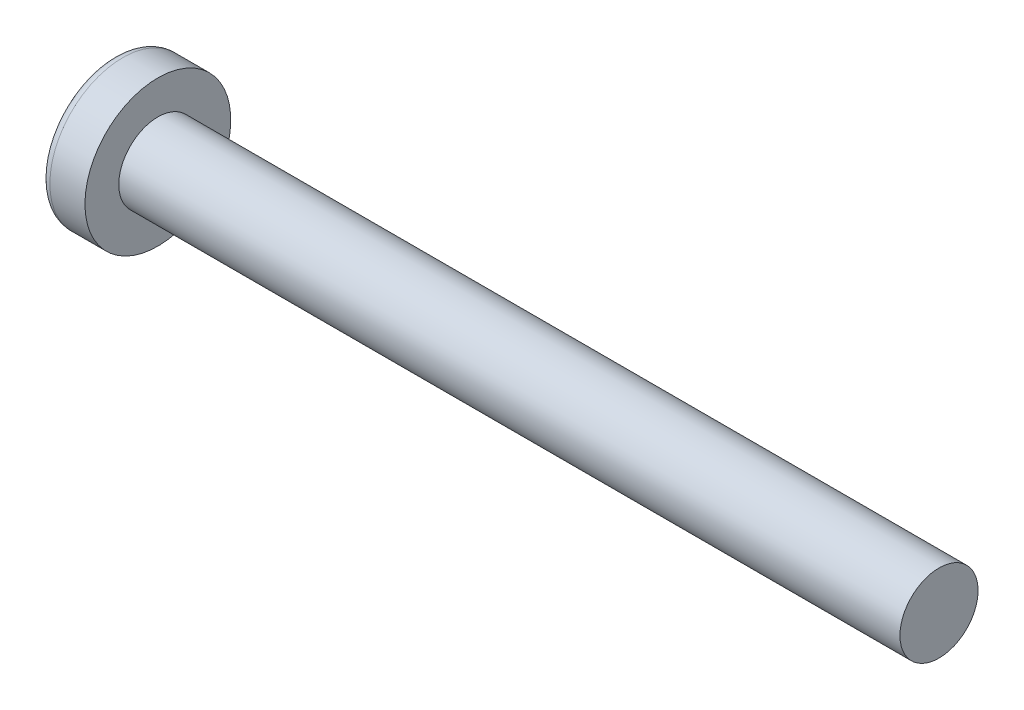
ISO-10303-21;
HEADER;
FILE_DESCRIPTION(('STEP AP214'),'2;1');
FILE_NAME('part.step','',(''),(''),'','','');
FILE_SCHEMA(('AUTOMOTIVE_DESIGN { 1 0 10303 214 1 1 1 1 }'));
ENDSEC;
DATA;
#1=APPLICATION_CONTEXT('core data for automotive mechanical design processes');
#2=APPLICATION_PROTOCOL_DEFINITION('international standard','automotive_design',2000,#1);
#3=PRODUCT_CONTEXT('',#1,'mechanical');
#4=PRODUCT('Part','Part','',(#3));
#5=PRODUCT_RELATED_PRODUCT_CATEGORY('part','',(#4));
#6=PRODUCT_DEFINITION_FORMATION('','',#4);
#7=PRODUCT_DEFINITION_CONTEXT('part definition',#1,'design');
#8=PRODUCT_DEFINITION('design','',#6,#7);
#9=PRODUCT_DEFINITION_SHAPE('','',#8);
#10=(LENGTH_UNIT() NAMED_UNIT(*) SI_UNIT(.MILLI.,.METRE.));
#11=(NAMED_UNIT(*) PLANE_ANGLE_UNIT() SI_UNIT($,.RADIAN.));
#12=(NAMED_UNIT(*) SI_UNIT($,.STERADIAN.) SOLID_ANGLE_UNIT());
#13=UNCERTAINTY_MEASURE_WITH_UNIT(LENGTH_MEASURE(1.E-05),#10,'distance_accuracy_value','');
#14=(GEOMETRIC_REPRESENTATION_CONTEXT(3) GLOBAL_UNCERTAINTY_ASSIGNED_CONTEXT((#13)) GLOBAL_UNIT_ASSIGNED_CONTEXT((#10,
#11,#12)) REPRESENTATION_CONTEXT('',''));
#15=CARTESIAN_POINT('',(0.,0.,0.));
#16=DIRECTION('',(0.,0.,1.));
#17=DIRECTION('',(1.,0.,0.));
#18=AXIS2_PLACEMENT_3D('',#15,#16,#17);
#19=CARTESIAN_POINT('',(5.,0.,0.));
#20=DIRECTION('',(-1.,0.,0.));
#21=DIRECTION('',(0.,1.,0.));
#22=AXIS2_PLACEMENT_3D('',#19,#20,#21);
#23=SPHERICAL_SURFACE('',#22,5.);
#24=CARTESIAN_POINT('',(0.74715070681048,0.,0.));
#25=DIRECTION('',(-1.,0.,0.));
#26=DIRECTION('',(0.,0.,1.));
#27=AXIS2_PLACEMENT_3D('',#24,#25,#26);
#28=CIRCLE('',#27,2.62931034482758);
#29=CARTESIAN_POINT('',(0.74715070681048,0.,2.62931034482758));
#30=VERTEX_POINT('',#29);
#31=EDGE_CURVE('E136',#30,#30,#28,.T.);
#32=ORIENTED_EDGE('',*,*,#31,.T.);
#33=EDGE_LOOP('',(#32));
#34=FACE_BOUND('',#33,.T.);
#35=CARTESIAN_POINT('',(4.98382636322272,-0.153868112043298,0.));
#36=DIRECTION('',(-0.104537710696287,-0.994520923380891,0.));
#37=DIRECTION('',(0.994520923380891,-0.104537710696287,0.));
#38=AXIS2_PLACEMENT_3D('',#35,#36,#37);
#39=CIRCLE('',#38,4.99760572850336);
#40=CARTESIAN_POINT('',(0.188596138461545,0.350175974082162,1.31444652548076));
#41=VERTEX_POINT('',#40);
#42=CARTESIAN_POINT('',(0.0270341343313624,0.367158343834486,0.367158343834487));
#43=VERTEX_POINT('',#42);
#44=EDGE_CURVE('E167',#41,#43,#39,.T.);
#45=ORIENTED_EDGE('',*,*,#44,.F.);
#46=CARTESIAN_POINT('',(3.98403090792016,0.,-1.41352221506761));
#47=DIRECTION('',(0.583636048152575,0.,0.812015371342713));
#48=DIRECTION('',(0.812015371342714,0.,-0.583636048152575));
#49=AXIS2_PLACEMENT_3D('',#46,#47,#48);
#50=CIRCLE('',#49,4.68719124331927);
#51=CARTESIAN_POINT('',(0.188596138461545,-0.350175974082171,1.31444652548076));
#52=VERTEX_POINT('',#51);
#53=EDGE_CURVE('E132',#41,#52,#50,.T.);
#54=ORIENTED_EDGE('',*,*,#53,.T.);
#55=CARTESIAN_POINT('',(4.98382636322272,0.153868112043297,0.));
#56=DIRECTION('',(-0.104537710696287,0.994520923380891,0.));
#57=DIRECTION('',(-0.994520923380891,-0.104537710696287,0.));
#58=AXIS2_PLACEMENT_3D('',#55,#56,#57);
#59=CIRCLE('',#58,4.99760572850336);
#60=CARTESIAN_POINT('',(0.0270341343313616,-0.367158343834489,0.367158343834487));
#61=VERTEX_POINT('',#60);
#62=EDGE_CURVE('E88',#61,#52,#59,.T.);
#63=ORIENTED_EDGE('',*,*,#62,.F.);
#64=CARTESIAN_POINT('',(4.98382636322272,0.,-0.153868112043297));
#65=DIRECTION('',(-0.104537710696287,0.,-0.994520923380891));
#66=DIRECTION('',(-0.994520923380891,0.,0.104537710696287));
#67=AXIS2_PLACEMENT_3D('',#64,#65,#66);
#68=CIRCLE('',#67,4.99760572850336);
#69=CARTESIAN_POINT('',(0.188596138461543,-1.31444652548077,0.350175974082167));
#70=VERTEX_POINT('',#69);
#71=EDGE_CURVE('E113',#70,#61,#68,.T.);
#72=ORIENTED_EDGE('',*,*,#71,.F.);
#73=CARTESIAN_POINT('',(3.98403090792016,1.41352221506761,0.));
#74=DIRECTION('',(0.583636048152575,-0.812015371342713,0.));
#75=DIRECTION('',(0.812015371342714,0.583636048152575,0.));
#76=AXIS2_PLACEMENT_3D('',#73,#74,#75);
#77=CIRCLE('',#76,4.68719124331927);
#78=CARTESIAN_POINT('',(0.188596138461543,-1.31444652548077,-0.350175974082167));
#79=VERTEX_POINT('',#78);
#80=EDGE_CURVE('E121',#70,#79,#77,.T.);
#81=ORIENTED_EDGE('',*,*,#80,.T.);
#82=CARTESIAN_POINT('',(4.98382636322272,0.,0.153868112043298));
#83=DIRECTION('',(-0.104537710696287,0.,0.994520923380891));
#84=DIRECTION('',(0.994520923380891,0.,0.104537710696287));
#85=AXIS2_PLACEMENT_3D('',#82,#83,#84);
#86=CIRCLE('',#85,4.99760572850336);
#87=CARTESIAN_POINT('',(0.0270341343313616,-0.367158343834486,-0.367158343834487));
#88=VERTEX_POINT('',#87);
#89=EDGE_CURVE('E31',#88,#79,#86,.T.);
#90=ORIENTED_EDGE('',*,*,#89,.F.);
#91=CARTESIAN_POINT('',(0.188596138461545,-0.350175974082162,-1.31444652548077));
#92=VERTEX_POINT('',#91);
#93=EDGE_CURVE('E174',#92,#88,#59,.T.);
#94=ORIENTED_EDGE('',*,*,#93,.F.);
#95=CARTESIAN_POINT('',(3.98403090792016,0.,1.41352221506761));
#96=DIRECTION('',(0.583636048152575,0.,-0.812015371342713));
#97=DIRECTION('',(-0.812015371342714,0.,-0.583636048152575));
#98=AXIS2_PLACEMENT_3D('',#95,#96,#97);
#99=CIRCLE('',#98,4.68719124331927);
#100=CARTESIAN_POINT('',(0.188596138461545,0.350175974082172,-1.31444652548076));
#101=VERTEX_POINT('',#100);
#102=EDGE_CURVE('E114',#92,#101,#99,.T.);
#103=ORIENTED_EDGE('',*,*,#102,.T.);
#104=CARTESIAN_POINT('',(0.0270341343313624,0.367158343834489,-0.367158343834487));
#105=VERTEX_POINT('',#104);
#106=EDGE_CURVE('E162',#105,#101,#39,.T.);
#107=ORIENTED_EDGE('',*,*,#106,.F.);
#108=CARTESIAN_POINT('',(0.188596138461545,1.31444652548076,-0.350175974082167));
#109=VERTEX_POINT('',#108);
#110=EDGE_CURVE('E24',#109,#105,#86,.T.);
#111=ORIENTED_EDGE('',*,*,#110,.F.);
#112=CARTESIAN_POINT('',(3.98403090792016,-1.41352221506761,0.));
#113=DIRECTION('',(0.583636048152575,0.812015371342713,0.));
#114=DIRECTION('',(-0.812015371342714,0.583636048152575,0.));
#115=AXIS2_PLACEMENT_3D('',#112,#113,#114);
#116=CIRCLE('',#115,4.68719124331927);
#117=CARTESIAN_POINT('',(0.188596138461545,1.31444652548076,0.350175974082167));
#118=VERTEX_POINT('',#117);
#119=EDGE_CURVE('E11',#109,#118,#116,.T.);
#120=ORIENTED_EDGE('',*,*,#119,.T.);
#121=EDGE_CURVE('E150',#43,#118,#68,.T.);
#122=ORIENTED_EDGE('',*,*,#121,.F.);
#123=EDGE_LOOP('',(#45,#54,#63,#72,#81,#90,#94,#103,#107,#111,#120,#122));
#124=FACE_BOUND('',#123,.T.);
#125=ADVANCED_FACE('F16',(#34,#124),#23,.T.);
#126=CARTESIAN_POINT('',(2.01739130434783,0.,-0.157944664031621));
#127=DIRECTION('',(-0.104537710696287,0.,0.994520923380891));
#128=DIRECTION('',(0.994520923380891,0.,0.104537710696287));
#129=AXIS2_PLACEMENT_3D('',#126,#127,#128);
#130=PLANE('',#129);
#131=ORIENTED_EDGE('',*,*,#110,.T.);
#132=DIRECTION('',(0.989130931836555,-0.103971149085093,0.103971149085092));
#133=VECTOR('',#132,1.);
#134=CARTESIAN_POINT('',(2.03363450411053,0.156237282238383,-0.156237282238382));
#135=LINE('',#134,#133);
#136=CARTESIAN_POINT('',(1.76,0.185,-0.185));
#137=VERTEX_POINT('',#136);
#138=EDGE_CURVE('E156',#105,#137,#135,.T.);
#139=ORIENTED_EDGE('',*,*,#138,.T.);
#140=DIRECTION('',(0.809073553388531,-0.581521616498006,0.0850446632823171));
#141=VECTOR('',#140,1.);
#142=CARTESIAN_POINT('',(0.,1.45,-0.37));
#143=LINE('',#142,#141);
#144=EDGE_CURVE('E137',#109,#137,#143,.T.);
#145=ORIENTED_EDGE('',*,*,#144,.F.);
#146=EDGE_LOOP('',(#131,#139,#145));
#147=FACE_BOUND('',#146,.T.);
#148=ADVANCED_FACE('F155',(#147),#130,.T.);
#149=DIRECTION('',(0.809073553388531,0.581521616498006,0.0850446632823171));
#150=VECTOR('',#149,1.);
#151=CARTESIAN_POINT('',(0.,-1.45,-0.37));
#152=LINE('',#151,#150);
#153=CARTESIAN_POINT('',(1.76,-0.185,-0.185));
#154=VERTEX_POINT('',#153);
#155=EDGE_CURVE('E122',#79,#154,#152,.T.);
#156=ORIENTED_EDGE('',*,*,#155,.T.);
#157=DIRECTION('',(-0.989130931836555,-0.103971149085092,-0.103971149085092));
#158=VECTOR('',#157,1.);
#159=CARTESIAN_POINT('',(2.03363450411053,-0.156237282238382,-0.156237282238382));
#160=LINE('',#159,#158);
#161=EDGE_CURVE('E177',#154,#88,#160,.T.);
#162=ORIENTED_EDGE('',*,*,#161,.T.);
#163=ORIENTED_EDGE('',*,*,#89,.T.);
#164=EDGE_LOOP('',(#156,#162,#163));
#165=FACE_BOUND('',#164,.T.);
#166=ADVANCED_FACE('F192',(#165),#130,.T.);
#167=CARTESIAN_POINT('',(2.01739130434783,0.,0.157944664031621));
#168=DIRECTION('',(-0.104537710696287,0.,-0.994520923380891));
#169=DIRECTION('',(-0.994520923380891,0.,0.104537710696287));
#170=AXIS2_PLACEMENT_3D('',#167,#168,#169);
#171=PLANE('',#170);
#172=DIRECTION('',(0.809073553388531,-0.581521616498006,-0.085044663282317));
#173=VECTOR('',#172,1.);
#174=CARTESIAN_POINT('',(0.,1.45,0.37));
#175=LINE('',#174,#173);
#176=CARTESIAN_POINT('',(1.76,0.185,0.185));
#177=VERTEX_POINT('',#176);
#178=EDGE_CURVE('E193',#118,#177,#175,.T.);
#179=ORIENTED_EDGE('',*,*,#178,.T.);
#180=DIRECTION('',(-0.989130931836555,0.103971149085092,0.103971149085092));
#181=VECTOR('',#180,1.);
#182=CARTESIAN_POINT('',(2.03363450411053,0.156237282238381,0.156237282238383));
#183=LINE('',#182,#181);
#184=EDGE_CURVE('E171',#177,#43,#183,.T.);
#185=ORIENTED_EDGE('',*,*,#184,.T.);
#186=ORIENTED_EDGE('',*,*,#121,.T.);
#187=EDGE_LOOP('',(#179,#185,#186));
#188=FACE_BOUND('',#187,.T.);
#189=ADVANCED_FACE('F197',(#188),#171,.T.);
#190=ORIENTED_EDGE('',*,*,#71,.T.);
#191=DIRECTION('',(0.989130931836555,0.103971149085092,-0.103971149085092));
#192=VECTOR('',#191,1.);
#193=CARTESIAN_POINT('',(2.03363450411053,-0.156237282238383,0.156237282238383));
#194=LINE('',#193,#192);
#195=CARTESIAN_POINT('',(1.76,-0.185,0.185));
#196=VERTEX_POINT('',#195);
#197=EDGE_CURVE('E86',#61,#196,#194,.T.);
#198=ORIENTED_EDGE('',*,*,#197,.T.);
#199=DIRECTION('',(0.809073553388531,0.581521616498006,-0.0850446632823169));
#200=VECTOR('',#199,1.);
#201=CARTESIAN_POINT('',(0.,-1.45,0.37));
#202=LINE('',#201,#200);
#203=EDGE_CURVE('E111',#70,#196,#202,.T.);
#204=ORIENTED_EDGE('',*,*,#203,.F.);
#205=EDGE_LOOP('',(#190,#198,#204));
#206=FACE_BOUND('',#205,.T.);
#207=ADVANCED_FACE('F110',(#206),#171,.T.);
#208=CARTESIAN_POINT('',(-25.4,0.,0.));
#209=DIRECTION('',(-1.,0.,0.));
#210=DIRECTION('',(0.,0.,1.));
#211=AXIS2_PLACEMENT_3D('',#208,#209,#210);
#212=CYLINDRICAL_SURFACE('',#211,1.5);
#213=CARTESIAN_POINT('',(32.4,0.,0.));
#214=DIRECTION('',(-1.,0.,0.));
#215=DIRECTION('',(0.,0.,1.));
#216=AXIS2_PLACEMENT_3D('',#213,#214,#215);
#217=CIRCLE('',#216,1.5);
#218=CARTESIAN_POINT('',(32.4,0.,1.5));
#219=VERTEX_POINT('',#218);
#220=EDGE_CURVE('E133',#219,#219,#217,.T.);
#221=ORIENTED_EDGE('',*,*,#220,.T.);
#222=EDGE_LOOP('',(#221));
#223=FACE_BOUND('',#222,.T.);
#224=CARTESIAN_POINT('',(2.4,0.,0.));
#225=DIRECTION('',(-1.,0.,0.));
#226=DIRECTION('',(0.,0.,1.));
#227=AXIS2_PLACEMENT_3D('',#224,#225,#226);
#228=CIRCLE('',#227,1.5);
#229=CARTESIAN_POINT('',(2.4,0.,1.5));
#230=VERTEX_POINT('',#229);
#231=EDGE_CURVE('E146',#230,#230,#228,.T.);
#232=ORIENTED_EDGE('',*,*,#231,.F.);
#233=EDGE_LOOP('',(#232));
#234=FACE_BOUND('',#233,.T.);
#235=ADVANCED_FACE('F18',(#223,#234),#212,.T.);
#236=CARTESIAN_POINT('',(2.4,1.5,0.));
#237=DIRECTION('',(-1.,0.,0.));
#238=DIRECTION('',(0.,0.,1.));
#239=AXIS2_PLACEMENT_3D('',#236,#237,#238);
#240=PLANE('',#239);
#241=CARTESIAN_POINT('',(2.4,0.,0.));
#242=DIRECTION('',(-1.,0.,0.));
#243=DIRECTION('',(0.,0.,1.));
#244=AXIS2_PLACEMENT_3D('',#241,#242,#243);
#245=CIRCLE('',#244,2.8);
#246=CARTESIAN_POINT('',(2.4,0.,2.8));
#247=VERTEX_POINT('',#246);
#248=EDGE_CURVE('E143',#247,#247,#245,.T.);
#249=ORIENTED_EDGE('',*,*,#248,.F.);
#250=EDGE_LOOP('',(#249));
#251=FACE_BOUND('',#250,.T.);
#252=ORIENTED_EDGE('',*,*,#231,.T.);
#253=EDGE_LOOP('',(#252));
#254=FACE_BOUND('',#253,.T.);
#255=ADVANCED_FACE('F226',(#251,#254),#240,.F.);
#256=CARTESIAN_POINT('',(-25.4,0.,0.));
#257=DIRECTION('',(-1.,0.,0.));
#258=DIRECTION('',(0.,0.,1.));
#259=AXIS2_PLACEMENT_3D('',#256,#257,#258);
#260=CYLINDRICAL_SURFACE('',#259,2.8);
#261=ORIENTED_EDGE('',*,*,#248,.T.);
#262=EDGE_LOOP('',(#261));
#263=FACE_BOUND('',#262,.T.);
#264=CARTESIAN_POINT('',(1.05335585592012,0.,0.));
#265=DIRECTION('',(-1.,0.,0.));
#266=DIRECTION('',(0.,0.,1.));
#267=AXIS2_PLACEMENT_3D('',#264,#265,#266);
#268=CIRCLE('',#267,2.8);
#269=CARTESIAN_POINT('',(1.05335585592012,0.,2.8));
#270=VERTEX_POINT('',#269);
#271=EDGE_CURVE('E140',#270,#270,#268,.T.);
#272=ORIENTED_EDGE('',*,*,#271,.F.);
#273=EDGE_LOOP('',(#272));
#274=FACE_BOUND('',#273,.T.);
#275=ADVANCED_FACE('F223',(#263,#274),#260,.T.);
#276=CARTESIAN_POINT('',(1.05335585592012,0.,0.));
#277=DIRECTION('',(-1.,0.,0.));
#278=DIRECTION('',(0.,0.,1.));
#279=AXIS2_PLACEMENT_3D('',#276,#277,#278);
#280=TOROIDAL_SURFACE('',#279,2.44,0.36);
#281=ORIENTED_EDGE('',*,*,#271,.T.);
#282=EDGE_LOOP('',(#281));
#283=FACE_BOUND('',#282,.T.);
#284=ORIENTED_EDGE('',*,*,#31,.F.);
#285=EDGE_LOOP('',(#284));
#286=FACE_BOUND('',#285,.T.);
#287=ADVANCED_FACE('F220',(#283,#286),#280,.T.);
#288=CARTESIAN_POINT('',(32.4,1.5,0.));
#289=DIRECTION('',(1.,0.,0.));
#290=DIRECTION('',(0.,0.,-1.));
#291=AXIS2_PLACEMENT_3D('',#288,#289,#290);
#292=PLANE('',#291);
#293=ORIENTED_EDGE('',*,*,#220,.F.);
#294=EDGE_LOOP('',(#293));
#295=FACE_BOUND('',#294,.T.);
#296=ADVANCED_FACE('F218',(#295),#292,.T.);
#297=CARTESIAN_POINT('',(1.76,0.185,0.185));
#298=DIRECTION('',(0.583636048152575,0.812015371342713,0.));
#299=DIRECTION('',(-0.812015371342714,0.583636048152575,0.));
#300=AXIS2_PLACEMENT_3D('',#297,#298,#299);
#301=PLANE('',#300);
#302=ORIENTED_EDGE('',*,*,#144,.T.);
#303=DIRECTION('',(0.,0.,-1.));
#304=VECTOR('',#303,1.);
#305=CARTESIAN_POINT('',(1.76,0.185,0.185));
#306=LINE('',#305,#304);
#307=EDGE_CURVE('E104',#177,#137,#306,.T.);
#308=ORIENTED_EDGE('',*,*,#307,.F.);
#309=ORIENTED_EDGE('',*,*,#178,.F.);
#310=ORIENTED_EDGE('',*,*,#119,.F.);
#311=EDGE_LOOP('',(#302,#308,#309,#310));
#312=FACE_BOUND('',#311,.T.);
#313=ADVANCED_FACE('F196',(#312),#301,.F.);
#314=CARTESIAN_POINT('',(1.76,-0.185,-0.185));
#315=DIRECTION('',(0.583636048152575,-0.812015371342713,0.));
#316=DIRECTION('',(0.812015371342714,0.583636048152575,0.));
#317=AXIS2_PLACEMENT_3D('',#314,#315,#316);
#318=PLANE('',#317);
#319=ORIENTED_EDGE('',*,*,#203,.T.);
#320=DIRECTION('',(0.,0.,1.));
#321=VECTOR('',#320,1.);
#322=CARTESIAN_POINT('',(1.76,-0.185,-0.185));
#323=LINE('',#322,#321);
#324=EDGE_CURVE('E103',#154,#196,#323,.T.);
#325=ORIENTED_EDGE('',*,*,#324,.F.);
#326=ORIENTED_EDGE('',*,*,#155,.F.);
#327=ORIENTED_EDGE('',*,*,#80,.F.);
#328=EDGE_LOOP('',(#319,#325,#326,#327));
#329=FACE_BOUND('',#328,.T.);
#330=ADVANCED_FACE('F118',(#329),#318,.F.);
#331=CARTESIAN_POINT('',(1.76,-0.185,-0.185));
#332=DIRECTION('',(1.,0.,0.));
#333=DIRECTION('',(0.,0.,-1.));
#334=AXIS2_PLACEMENT_3D('',#331,#332,#333);
#335=PLANE('',#334);
#336=DIRECTION('',(0.,1.,0.));
#337=VECTOR('',#336,1.);
#338=CARTESIAN_POINT('',(1.76,-0.185,-0.185));
#339=LINE('',#338,#337);
#340=EDGE_CURVE('E126',#154,#137,#339,.T.);
#341=ORIENTED_EDGE('',*,*,#340,.F.);
#342=ORIENTED_EDGE('',*,*,#324,.T.);
#343=DIRECTION('',(0.,-1.,0.));
#344=VECTOR('',#343,1.);
#345=CARTESIAN_POINT('',(1.76,0.185,0.185));
#346=LINE('',#345,#344);
#347=EDGE_CURVE('E95',#177,#196,#346,.T.);
#348=ORIENTED_EDGE('',*,*,#347,.F.);
#349=ORIENTED_EDGE('',*,*,#307,.T.);
#350=EDGE_LOOP('',(#341,#342,#348,#349));
#351=FACE_BOUND('',#350,.T.);
#352=ADVANCED_FACE('F124',(#351),#335,.F.);
#353=CARTESIAN_POINT('',(1.76,0.185,-0.185));
#354=DIRECTION('',(0.583636048152575,0.,-0.812015371342713));
#355=DIRECTION('',(0.812015371342714,0.,0.583636048152575));
#356=AXIS2_PLACEMENT_3D('',#353,#354,#355);
#357=PLANE('',#356);
#358=DIRECTION('',(0.809073553388531,0.0850446632823149,0.581521616498007));
#359=VECTOR('',#358,1.);
#360=CARTESIAN_POINT('',(0.,-0.369999999999994,-1.45));
#361=LINE('',#360,#359);
#362=EDGE_CURVE('E182',#92,#154,#361,.T.);
#363=ORIENTED_EDGE('',*,*,#362,.T.);
#364=ORIENTED_EDGE('',*,*,#340,.T.);
#365=DIRECTION('',(0.809073553388531,-0.0850446632823192,0.581521616498006));
#366=VECTOR('',#365,1.);
#367=CARTESIAN_POINT('',(0.,0.370000000000005,-1.45));
#368=LINE('',#367,#366);
#369=EDGE_CURVE('E92',#101,#137,#368,.T.);
#370=ORIENTED_EDGE('',*,*,#369,.F.);
#371=ORIENTED_EDGE('',*,*,#102,.F.);
#372=EDGE_LOOP('',(#363,#364,#370,#371));
#373=FACE_BOUND('',#372,.T.);
#374=ADVANCED_FACE('F187',(#373),#357,.F.);
#375=CARTESIAN_POINT('',(2.01739130434783,-0.157944664031621,0.));
#376=DIRECTION('',(-0.104537710696287,0.994520923380891,0.));
#377=DIRECTION('',(-0.994520923380891,-0.104537710696287,0.));
#378=AXIS2_PLACEMENT_3D('',#375,#376,#377);
#379=PLANE('',#378);
#380=ORIENTED_EDGE('',*,*,#93,.T.);
#381=ORIENTED_EDGE('',*,*,#161,.F.);
#382=ORIENTED_EDGE('',*,*,#362,.F.);
#383=EDGE_LOOP('',(#380,#381,#382));
#384=FACE_BOUND('',#383,.T.);
#385=ADVANCED_FACE('F191',(#384),#379,.T.);
#386=CARTESIAN_POINT('',(2.01739130434783,0.157944664031621,0.));
#387=DIRECTION('',(-0.104537710696287,-0.994520923380891,0.));
#388=DIRECTION('',(0.994520923380891,-0.104537710696287,0.));
#389=AXIS2_PLACEMENT_3D('',#386,#387,#388);
#390=PLANE('',#389);
#391=ORIENTED_EDGE('',*,*,#106,.T.);
#392=ORIENTED_EDGE('',*,*,#369,.T.);
#393=ORIENTED_EDGE('',*,*,#138,.F.);
#394=EDGE_LOOP('',(#391,#392,#393));
#395=FACE_BOUND('',#394,.T.);
#396=ADVANCED_FACE('F185',(#395),#390,.T.);
#397=CARTESIAN_POINT('',(1.76,-0.185,0.185));
#398=DIRECTION('',(0.583636048152575,0.,0.812015371342713));
#399=DIRECTION('',(-0.812015371342714,0.,0.583636048152575));
#400=AXIS2_PLACEMENT_3D('',#397,#398,#399);
#401=PLANE('',#400);
#402=DIRECTION('',(0.809073553388531,-0.0850446632823151,-0.581521616498007));
#403=VECTOR('',#402,1.);
#404=CARTESIAN_POINT('',(0.,0.369999999999995,1.45));
#405=LINE('',#404,#403);
#406=EDGE_CURVE('E91',#41,#177,#405,.T.);
#407=ORIENTED_EDGE('',*,*,#406,.T.);
#408=ORIENTED_EDGE('',*,*,#347,.T.);
#409=DIRECTION('',(0.809073553388531,0.085044663282319,-0.581521616498006));
#410=VECTOR('',#409,1.);
#411=CARTESIAN_POINT('',(0.,-0.370000000000005,1.45));
#412=LINE('',#411,#410);
#413=EDGE_CURVE('E82',#52,#196,#412,.T.);
#414=ORIENTED_EDGE('',*,*,#413,.F.);
#415=ORIENTED_EDGE('',*,*,#53,.F.);
#416=EDGE_LOOP('',(#407,#408,#414,#415));
#417=FACE_BOUND('',#416,.T.);
#418=ADVANCED_FACE('F96',(#417),#401,.F.);
#419=ORIENTED_EDGE('',*,*,#44,.T.);
#420=ORIENTED_EDGE('',*,*,#184,.F.);
#421=ORIENTED_EDGE('',*,*,#406,.F.);
#422=EDGE_LOOP('',(#419,#420,#421));
#423=FACE_BOUND('',#422,.T.);
#424=ADVANCED_FACE('F198',(#423),#390,.T.);
#425=ORIENTED_EDGE('',*,*,#62,.T.);
#426=ORIENTED_EDGE('',*,*,#413,.T.);
#427=ORIENTED_EDGE('',*,*,#197,.F.);
#428=EDGE_LOOP('',(#425,#426,#427));
#429=FACE_BOUND('',#428,.T.);
#430=ADVANCED_FACE('F84',(#429),#379,.T.);
#431=CLOSED_SHELL('',(#125,#148,#166,#189,#207,#235,#255,#275,#287,#296,#313,#330,#352,#374,
#385,#396,#418,#424,#430));
#432=MANIFOLD_SOLID_BREP('B1',#431);
#433=ADVANCED_BREP_SHAPE_REPRESENTATION('',(#18,#432),#14);
#434=SHAPE_DEFINITION_REPRESENTATION(#9,#433);
ENDSEC;
END-ISO-10303-21;
